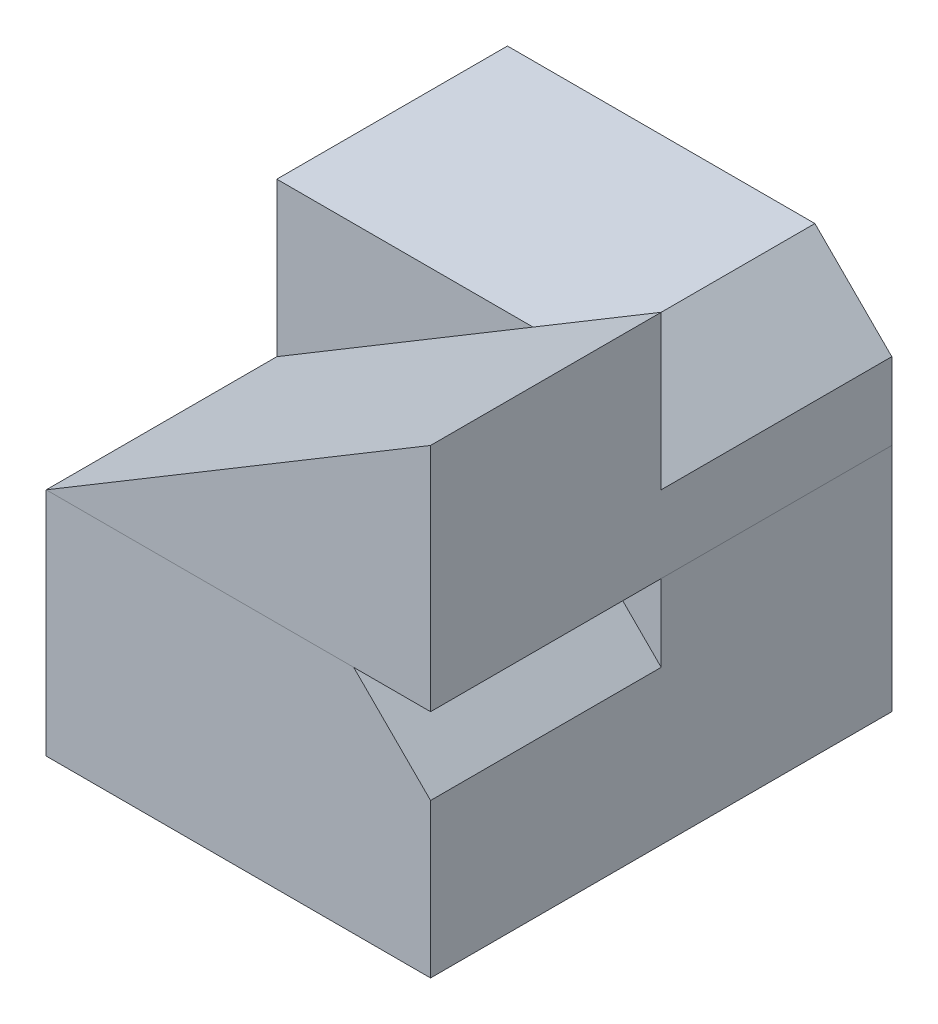
ISO-10303-21;
HEADER;
FILE_DESCRIPTION(('STEP AP214'),'2;1');
FILE_NAME('part.step','',(''),(''),'','','');
FILE_SCHEMA(('AUTOMOTIVE_DESIGN { 1 0 10303 214 1 1 1 1 }'));
ENDSEC;
DATA;
#1=APPLICATION_CONTEXT('core data for automotive mechanical design processes');
#2=APPLICATION_PROTOCOL_DEFINITION('international standard','automotive_design',2000,#1);
#3=PRODUCT_CONTEXT('',#1,'mechanical');
#4=PRODUCT('Part','Part','',(#3));
#5=PRODUCT_RELATED_PRODUCT_CATEGORY('part','',(#4));
#6=PRODUCT_DEFINITION_FORMATION('','',#4);
#7=PRODUCT_DEFINITION_CONTEXT('part definition',#1,'design');
#8=PRODUCT_DEFINITION('design','',#6,#7);
#9=PRODUCT_DEFINITION_SHAPE('','',#8);
#10=(LENGTH_UNIT() NAMED_UNIT(*) SI_UNIT(.MILLI.,.METRE.));
#11=(NAMED_UNIT(*) PLANE_ANGLE_UNIT() SI_UNIT($,.RADIAN.));
#12=(NAMED_UNIT(*) SI_UNIT($,.STERADIAN.) SOLID_ANGLE_UNIT());
#13=UNCERTAINTY_MEASURE_WITH_UNIT(LENGTH_MEASURE(1.E-05),#10,'distance_accuracy_value','');
#14=(GEOMETRIC_REPRESENTATION_CONTEXT(3) GLOBAL_UNCERTAINTY_ASSIGNED_CONTEXT((#13)) GLOBAL_UNIT_ASSIGNED_CONTEXT((#10,
#11,#12)) REPRESENTATION_CONTEXT('',''));
#15=CARTESIAN_POINT('',(0.,0.,0.));
#16=DIRECTION('',(0.,0.,1.));
#17=DIRECTION('',(1.,0.,0.));
#18=AXIS2_PLACEMENT_3D('',#15,#16,#17);
#19=CARTESIAN_POINT('',(0.,30.,30.));
#20=DIRECTION('',(0.514495755427526,-0.857492925712544,0.));
#21=DIRECTION('',(0.857492925712544,0.514495755427526,0.));
#22=AXIS2_PLACEMENT_3D('',#19,#20,#21);
#23=PLANE('',#22);
#24=DIRECTION('',(-0.857492925712544,-0.514495755427526,0.));
#25=VECTOR('',#24,1.);
#26=CARTESIAN_POINT('',(0.,30.,15.));
#27=LINE('',#26,#25);
#28=CARTESIAN_POINT('',(0.,30.,15.));
#29=VERTEX_POINT('',#28);
#30=CARTESIAN_POINT('',(-8.33333333333333,25.,15.));
#31=VERTEX_POINT('',#30);
#32=EDGE_CURVE('E128',#29,#31,#27,.T.);
#33=ORIENTED_EDGE('',*,*,#32,.T.);
#34=CARTESIAN_POINT('',(-25.,15.,15.));
#35=VERTEX_POINT('',#34);
#36=EDGE_CURVE('E126',#31,#35,#27,.T.);
#37=ORIENTED_EDGE('',*,*,#36,.T.);
#38=DIRECTION('',(0.,0.,-1.));
#39=VECTOR('',#38,1.);
#40=CARTESIAN_POINT('',(-25.,15.,30.));
#41=LINE('',#40,#39);
#42=CARTESIAN_POINT('',(-25.,15.,30.));
#43=VERTEX_POINT('',#42);
#44=EDGE_CURVE('E51',#43,#35,#41,.T.);
#45=ORIENTED_EDGE('',*,*,#44,.F.);
#46=DIRECTION('',(-0.857492925712544,-0.514495755427526,0.));
#47=VECTOR('',#46,1.);
#48=CARTESIAN_POINT('',(0.,30.,30.));
#49=LINE('',#48,#47);
#50=CARTESIAN_POINT('',(0.,30.,30.));
#51=VERTEX_POINT('',#50);
#52=EDGE_CURVE('E134',#51,#43,#49,.T.);
#53=ORIENTED_EDGE('',*,*,#52,.F.);
#54=DIRECTION('',(0.,0.,-1.));
#55=VECTOR('',#54,1.);
#56=CARTESIAN_POINT('',(0.,30.,30.));
#57=LINE('',#56,#55);
#58=EDGE_CURVE('E140',#51,#29,#57,.T.);
#59=ORIENTED_EDGE('',*,*,#58,.T.);
#60=EDGE_LOOP('',(#33,#37,#45,#53,#59));
#61=FACE_BOUND('',#60,.T.);
#62=ADVANCED_FACE('F43',(#61),#23,.F.);
#63=CARTESIAN_POINT('',(-25.,15.,30.));
#64=DIRECTION('',(0.,1.,0.));
#65=DIRECTION('',(0.,0.,1.));
#66=AXIS2_PLACEMENT_3D('',#63,#64,#65);
#67=PLANE('',#66);
#68=ORIENTED_EDGE('',*,*,#44,.T.);
#69=DIRECTION('',(0.,0.,1.));
#70=VECTOR('',#69,1.);
#71=CARTESIAN_POINT('',(-25.,15.,0.));
#72=LINE('',#71,#70);
#73=CARTESIAN_POINT('',(-25.,15.,0.));
#74=VERTEX_POINT('',#73);
#75=EDGE_CURVE('E105',#74,#35,#72,.T.);
#76=ORIENTED_EDGE('',*,*,#75,.F.);
#77=DIRECTION('',(-1.,0.,0.));
#78=VECTOR('',#77,1.);
#79=CARTESIAN_POINT('',(0.,15.,0.));
#80=LINE('',#79,#78);
#81=CARTESIAN_POINT('',(0.,15.,0.));
#82=VERTEX_POINT('',#81);
#83=EDGE_CURVE('E111',#82,#74,#80,.T.);
#84=ORIENTED_EDGE('',*,*,#83,.F.);
#85=DIRECTION('',(0.,0.,-1.));
#86=VECTOR('',#85,1.);
#87=CARTESIAN_POINT('',(0.,15.,30.));
#88=LINE('',#87,#86);
#89=CARTESIAN_POINT('',(0.,15.,30.));
#90=VERTEX_POINT('',#89);
#91=EDGE_CURVE('E198',#90,#82,#88,.T.);
#92=ORIENTED_EDGE('',*,*,#91,.F.);
#93=DIRECTION('',(1.,0.,0.));
#94=VECTOR('',#93,1.);
#95=CARTESIAN_POINT('',(-25.,15.,30.));
#96=LINE('',#95,#94);
#97=EDGE_CURVE('E137',#43,#90,#96,.T.);
#98=ORIENTED_EDGE('',*,*,#97,.F.);
#99=EDGE_LOOP('',(#68,#76,#84,#92,#98));
#100=FACE_BOUND('',#99,.T.);
#101=ADVANCED_FACE('F123',(#100),#67,.F.);
#102=CARTESIAN_POINT('',(0.,15.,30.));
#103=DIRECTION('',(-1.,0.,0.));
#104=DIRECTION('',(0.,0.,1.));
#105=AXIS2_PLACEMENT_3D('',#102,#103,#104);
#106=PLANE('',#105);
#107=ORIENTED_EDGE('',*,*,#91,.T.);
#108=DIRECTION('',(0.,-1.,0.));
#109=VECTOR('',#108,1.);
#110=CARTESIAN_POINT('',(0.,20.,0.));
#111=LINE('',#110,#109);
#112=CARTESIAN_POINT('',(0.,20.,0.));
#113=VERTEX_POINT('',#112);
#114=EDGE_CURVE('E117',#113,#82,#111,.T.);
#115=ORIENTED_EDGE('',*,*,#114,.F.);
#116=DIRECTION('',(0.,0.,1.));
#117=VECTOR('',#116,1.);
#118=CARTESIAN_POINT('',(0.,20.,0.));
#119=LINE('',#118,#117);
#120=CARTESIAN_POINT('',(0.,20.,15.));
#121=VERTEX_POINT('',#120);
#122=EDGE_CURVE('E149',#113,#121,#119,.T.);
#123=ORIENTED_EDGE('',*,*,#122,.T.);
#124=DIRECTION('',(0.,1.,0.));
#125=VECTOR('',#124,1.);
#126=CARTESIAN_POINT('',(0.,15.,15.));
#127=LINE('',#126,#125);
#128=EDGE_CURVE('E60',#121,#29,#127,.T.);
#129=ORIENTED_EDGE('',*,*,#128,.T.);
#130=ORIENTED_EDGE('',*,*,#58,.F.);
#131=DIRECTION('',(0.,1.,0.));
#132=VECTOR('',#131,1.);
#133=CARTESIAN_POINT('',(0.,15.,30.));
#134=LINE('',#133,#132);
#135=EDGE_CURVE('E139',#90,#51,#134,.T.);
#136=ORIENTED_EDGE('',*,*,#135,.F.);
#137=EDGE_LOOP('',(#107,#115,#123,#129,#130,#136));
#138=FACE_BOUND('',#137,.T.);
#139=ADVANCED_FACE('F184',(#138),#106,.F.);
#140=CARTESIAN_POINT('',(0.,0.,30.));
#141=DIRECTION('',(0.,0.,-1.));
#142=DIRECTION('',(-1.,0.,0.));
#143=AXIS2_PLACEMENT_3D('',#140,#141,#142);
#144=PLANE('',#143);
#145=ORIENTED_EDGE('',*,*,#52,.T.);
#146=ORIENTED_EDGE('',*,*,#97,.T.);
#147=ORIENTED_EDGE('',*,*,#135,.T.);
#148=EDGE_LOOP('',(#145,#146,#147));
#149=FACE_BOUND('',#148,.T.);
#150=ADVANCED_FACE('F177',(#149),#144,.F.);
#151=CARTESIAN_POINT('',(0.,0.,15.));
#152=DIRECTION('',(0.,0.,-1.));
#153=DIRECTION('',(-1.,0.,0.));
#154=AXIS2_PLACEMENT_3D('',#151,#152,#153);
#155=PLANE('',#154);
#156=DIRECTION('',(0.707106781186548,-0.707106781186547,0.));
#157=VECTOR('',#156,1.);
#158=CARTESIAN_POINT('',(-5.,25.,15.));
#159=LINE('',#158,#157);
#160=CARTESIAN_POINT('',(-5.,25.,15.));
#161=VERTEX_POINT('',#160);
#162=EDGE_CURVE('E120',#161,#121,#159,.T.);
#163=ORIENTED_EDGE('',*,*,#162,.F.);
#164=DIRECTION('',(1.,0.,0.));
#165=VECTOR('',#164,1.);
#166=CARTESIAN_POINT('',(-25.,25.,15.));
#167=LINE('',#166,#165);
#168=EDGE_CURVE('E12',#31,#161,#167,.T.);
#169=ORIENTED_EDGE('',*,*,#168,.F.);
#170=ORIENTED_EDGE('',*,*,#32,.F.);
#171=ORIENTED_EDGE('',*,*,#128,.F.);
#172=EDGE_LOOP('',(#163,#169,#170,#171));
#173=FACE_BOUND('',#172,.T.);
#174=ADVANCED_FACE('F175',(#173),#155,.T.);
#175=CARTESIAN_POINT('',(-25.,15.,0.));
#176=DIRECTION('',(1.,0.,0.));
#177=DIRECTION('',(0.,0.,-1.));
#178=AXIS2_PLACEMENT_3D('',#175,#176,#177);
#179=PLANE('',#178);
#180=DIRECTION('',(0.,1.,0.));
#181=VECTOR('',#180,1.);
#182=CARTESIAN_POINT('',(-25.,15.,15.));
#183=LINE('',#182,#181);
#184=CARTESIAN_POINT('',(-25.,25.,15.));
#185=VERTEX_POINT('',#184);
#186=EDGE_CURVE('E163',#35,#185,#183,.T.);
#187=ORIENTED_EDGE('',*,*,#186,.T.);
#188=DIRECTION('',(0.,0.,1.));
#189=VECTOR('',#188,1.);
#190=CARTESIAN_POINT('',(-25.,25.,0.));
#191=LINE('',#190,#189);
#192=CARTESIAN_POINT('',(-25.,25.,0.));
#193=VERTEX_POINT('',#192);
#194=EDGE_CURVE('E107',#193,#185,#191,.T.);
#195=ORIENTED_EDGE('',*,*,#194,.F.);
#196=DIRECTION('',(0.,1.,0.));
#197=VECTOR('',#196,1.);
#198=CARTESIAN_POINT('',(-25.,15.,0.));
#199=LINE('',#198,#197);
#200=EDGE_CURVE('E101',#74,#193,#199,.T.);
#201=ORIENTED_EDGE('',*,*,#200,.F.);
#202=ORIENTED_EDGE('',*,*,#75,.T.);
#203=EDGE_LOOP('',(#187,#195,#201,#202));
#204=FACE_BOUND('',#203,.T.);
#205=ADVANCED_FACE('F103',(#204),#179,.F.);
#206=CARTESIAN_POINT('',(-25.,25.,0.));
#207=DIRECTION('',(0.,-1.,0.));
#208=DIRECTION('',(1.,0.,0.));
#209=AXIS2_PLACEMENT_3D('',#206,#207,#208);
#210=PLANE('',#209);
#211=EDGE_CURVE('E53',#185,#31,#167,.T.);
#212=ORIENTED_EDGE('',*,*,#211,.T.);
#213=ORIENTED_EDGE('',*,*,#168,.T.);
#214=DIRECTION('',(0.,0.,1.));
#215=VECTOR('',#214,1.);
#216=CARTESIAN_POINT('',(-5.,25.,0.));
#217=LINE('',#216,#215);
#218=CARTESIAN_POINT('',(-5.,25.,0.));
#219=VERTEX_POINT('',#218);
#220=EDGE_CURVE('E130',#219,#161,#217,.T.);
#221=ORIENTED_EDGE('',*,*,#220,.F.);
#222=DIRECTION('',(1.,0.,0.));
#223=VECTOR('',#222,1.);
#224=CARTESIAN_POINT('',(-25.,25.,0.));
#225=LINE('',#224,#223);
#226=EDGE_CURVE('E110',#193,#219,#225,.T.);
#227=ORIENTED_EDGE('',*,*,#226,.F.);
#228=ORIENTED_EDGE('',*,*,#194,.T.);
#229=EDGE_LOOP('',(#212,#213,#221,#227,#228));
#230=FACE_BOUND('',#229,.T.);
#231=ADVANCED_FACE('F167',(#230),#210,.F.);
#232=CARTESIAN_POINT('',(-5.,25.,0.));
#233=DIRECTION('',(-0.707106781186547,-0.707106781186548,0.));
#234=DIRECTION('',(0.707106781186548,-0.707106781186547,0.));
#235=AXIS2_PLACEMENT_3D('',#232,#233,#234);
#236=PLANE('',#235);
#237=ORIENTED_EDGE('',*,*,#162,.T.);
#238=ORIENTED_EDGE('',*,*,#122,.F.);
#239=DIRECTION('',(0.707106781186548,-0.707106781186547,0.));
#240=VECTOR('',#239,1.);
#241=CARTESIAN_POINT('',(-5.,25.,0.));
#242=LINE('',#241,#240);
#243=EDGE_CURVE('E159',#219,#113,#242,.T.);
#244=ORIENTED_EDGE('',*,*,#243,.F.);
#245=ORIENTED_EDGE('',*,*,#220,.T.);
#246=EDGE_LOOP('',(#237,#238,#244,#245));
#247=FACE_BOUND('',#246,.T.);
#248=ADVANCED_FACE('F237',(#247),#236,.F.);
#249=CARTESIAN_POINT('',(0.,0.,0.));
#250=DIRECTION('',(0.,0.,-1.));
#251=DIRECTION('',(-1.,0.,0.));
#252=AXIS2_PLACEMENT_3D('',#249,#250,#251);
#253=PLANE('',#252);
#254=ORIENTED_EDGE('',*,*,#83,.T.);
#255=ORIENTED_EDGE('',*,*,#200,.T.);
#256=ORIENTED_EDGE('',*,*,#226,.T.);
#257=ORIENTED_EDGE('',*,*,#243,.T.);
#258=ORIENTED_EDGE('',*,*,#114,.T.);
#259=EDGE_LOOP('',(#254,#255,#256,#257,#258));
#260=FACE_BOUND('',#259,.T.);
#261=ADVANCED_FACE('F115',(#260),#253,.T.);
#262=CARTESIAN_POINT('',(0.,0.,15.));
#263=DIRECTION('',(0.,0.,-1.));
#264=DIRECTION('',(-1.,0.,0.));
#265=AXIS2_PLACEMENT_3D('',#262,#263,#264);
#266=PLANE('',#265);
#267=ORIENTED_EDGE('',*,*,#36,.F.);
#268=ORIENTED_EDGE('',*,*,#211,.F.);
#269=ORIENTED_EDGE('',*,*,#186,.F.);
#270=EDGE_LOOP('',(#267,#268,#269));
#271=FACE_BOUND('',#270,.T.);
#272=ADVANCED_FACE('F170',(#271),#266,.F.);
#273=CLOSED_SHELL('',(#62,#101,#139,#150,#174,#205,#231,#248,#261,#272));
#274=MANIFOLD_SOLID_BREP('B2',#273);
#275=CARTESIAN_POINT('',(0.,0.,15.));
#276=DIRECTION('',(0.,0.,-1.));
#277=DIRECTION('',(-1.,0.,0.));
#278=AXIS2_PLACEMENT_3D('',#275,#276,#277);
#279=PLANE('',#278);
#280=DIRECTION('',(-0.707106781186548,0.707106781186547,0.));
#281=VECTOR('',#280,1.);
#282=CARTESIAN_POINT('',(-5.,15.,15.));
#283=LINE('',#282,#281);
#284=CARTESIAN_POINT('',(0.,10.,15.));
#285=VERTEX_POINT('',#284);
#286=CARTESIAN_POINT('',(-3.125,13.125,15.));
#287=VERTEX_POINT('',#286);
#288=EDGE_CURVE('E286',#285,#287,#283,.T.);
#289=ORIENTED_EDGE('',*,*,#288,.F.);
#290=DIRECTION('',(0.,1.,0.));
#291=VECTOR('',#290,1.);
#292=CARTESIAN_POINT('',(0.,0.,15.));
#293=LINE('',#292,#291);
#294=CARTESIAN_POINT('',(0.,15.,15.));
#295=VERTEX_POINT('',#294);
#296=EDGE_CURVE('E290',#285,#295,#293,.T.);
#297=ORIENTED_EDGE('',*,*,#296,.T.);
#298=DIRECTION('',(-0.857492925712544,-0.514495755427526,0.));
#299=VECTOR('',#298,1.);
#300=CARTESIAN_POINT('',(0.,15.,15.));
#301=LINE('',#300,#299);
#302=EDGE_CURVE('E323',#295,#287,#301,.T.);
#303=ORIENTED_EDGE('',*,*,#302,.T.);
#304=EDGE_LOOP('',(#289,#297,#303));
#305=FACE_BOUND('',#304,.T.);
#306=ADVANCED_FACE('F269',(#305),#279,.F.);
#307=CARTESIAN_POINT('',(0.,15.,15.));
#308=DIRECTION('',(0.514495755427526,-0.857492925712544,0.));
#309=DIRECTION('',(0.857492925712544,0.514495755427526,0.));
#310=AXIS2_PLACEMENT_3D('',#307,#308,#309);
#311=PLANE('',#310);
#312=DIRECTION('',(-0.857492925712544,-0.514495755427526,0.));
#313=VECTOR('',#312,1.);
#314=CARTESIAN_POINT('',(0.,15.,0.));
#315=LINE('',#314,#313);
#316=CARTESIAN_POINT('',(0.,15.,0.));
#317=VERTEX_POINT('',#316);
#318=CARTESIAN_POINT('',(-25.,0.,0.));
#319=VERTEX_POINT('',#318);
#320=EDGE_CURVE('E321',#317,#319,#315,.T.);
#321=ORIENTED_EDGE('',*,*,#320,.T.);
#322=DIRECTION('',(0.,0.,-1.));
#323=VECTOR('',#322,1.);
#324=CARTESIAN_POINT('',(-25.,0.,15.));
#325=LINE('',#324,#323);
#326=CARTESIAN_POINT('',(-25.,0.,15.));
#327=VERTEX_POINT('',#326);
#328=EDGE_CURVE('E41',#327,#319,#325,.T.);
#329=ORIENTED_EDGE('',*,*,#328,.F.);
#330=EDGE_CURVE('E316',#287,#327,#301,.T.);
#331=ORIENTED_EDGE('',*,*,#330,.F.);
#332=ORIENTED_EDGE('',*,*,#302,.F.);
#333=DIRECTION('',(0.,0.,-1.));
#334=VECTOR('',#333,1.);
#335=CARTESIAN_POINT('',(0.,15.,15.));
#336=LINE('',#335,#334);
#337=EDGE_CURVE('E310',#295,#317,#336,.T.);
#338=ORIENTED_EDGE('',*,*,#337,.T.);
#339=EDGE_LOOP('',(#321,#329,#331,#332,#338));
#340=FACE_BOUND('',#339,.T.);
#341=ADVANCED_FACE('F271',(#340),#311,.F.);
#342=CARTESIAN_POINT('',(-25.,0.,15.));
#343=DIRECTION('',(0.,1.,0.));
#344=DIRECTION('',(0.,0.,1.));
#345=AXIS2_PLACEMENT_3D('',#342,#343,#344);
#346=PLANE('',#345);
#347=DIRECTION('',(1.,0.,0.));
#348=VECTOR('',#347,1.);
#349=CARTESIAN_POINT('',(-25.,0.,0.));
#350=LINE('',#349,#348);
#351=CARTESIAN_POINT('',(0.,0.,0.));
#352=VERTEX_POINT('',#351);
#353=EDGE_CURVE('E317',#319,#352,#350,.T.);
#354=ORIENTED_EDGE('',*,*,#353,.T.);
#355=DIRECTION('',(0.,0.,-1.));
#356=VECTOR('',#355,1.);
#357=CARTESIAN_POINT('',(0.,0.,15.));
#358=LINE('',#357,#356);
#359=CARTESIAN_POINT('',(0.,0.,30.));
#360=VERTEX_POINT('',#359);
#361=EDGE_CURVE('E278',#360,#352,#358,.T.);
#362=ORIENTED_EDGE('',*,*,#361,.F.);
#363=DIRECTION('',(1.,0.,0.));
#364=VECTOR('',#363,1.);
#365=CARTESIAN_POINT('',(0.,0.,30.));
#366=LINE('',#365,#364);
#367=CARTESIAN_POINT('',(-25.,0.,30.));
#368=VERTEX_POINT('',#367);
#369=EDGE_CURVE('E351',#368,#360,#366,.T.);
#370=ORIENTED_EDGE('',*,*,#369,.F.);
#371=DIRECTION('',(0.,0.,-1.));
#372=VECTOR('',#371,1.);
#373=CARTESIAN_POINT('',(-25.,0.,30.));
#374=LINE('',#373,#372);
#375=EDGE_CURVE('E352',#368,#327,#374,.T.);
#376=ORIENTED_EDGE('',*,*,#375,.T.);
#377=ORIENTED_EDGE('',*,*,#328,.T.);
#378=EDGE_LOOP('',(#354,#362,#370,#376,#377));
#379=FACE_BOUND('',#378,.T.);
#380=ADVANCED_FACE('F374',(#379),#346,.F.);
#381=CARTESIAN_POINT('',(0.,0.,15.));
#382=DIRECTION('',(-1.,0.,0.));
#383=DIRECTION('',(0.,0.,1.));
#384=AXIS2_PLACEMENT_3D('',#381,#382,#383);
#385=PLANE('',#384);
#386=DIRECTION('',(0.,1.,0.));
#387=VECTOR('',#386,1.);
#388=CARTESIAN_POINT('',(0.,0.,0.));
#389=LINE('',#388,#387);
#390=EDGE_CURVE('E307',#352,#317,#389,.T.);
#391=ORIENTED_EDGE('',*,*,#390,.T.);
#392=ORIENTED_EDGE('',*,*,#337,.F.);
#393=ORIENTED_EDGE('',*,*,#296,.F.);
#394=DIRECTION('',(0.,0.,-1.));
#395=VECTOR('',#394,1.);
#396=CARTESIAN_POINT('',(0.,10.,30.));
#397=LINE('',#396,#395);
#398=CARTESIAN_POINT('',(0.,10.,30.));
#399=VERTEX_POINT('',#398);
#400=EDGE_CURVE('E326',#399,#285,#397,.T.);
#401=ORIENTED_EDGE('',*,*,#400,.F.);
#402=DIRECTION('',(0.,1.,0.));
#403=VECTOR('',#402,1.);
#404=CARTESIAN_POINT('',(0.,10.,30.));
#405=LINE('',#404,#403);
#406=EDGE_CURVE('E382',#360,#399,#405,.T.);
#407=ORIENTED_EDGE('',*,*,#406,.F.);
#408=ORIENTED_EDGE('',*,*,#361,.T.);
#409=EDGE_LOOP('',(#391,#392,#393,#401,#407,#408));
#410=FACE_BOUND('',#409,.T.);
#411=ADVANCED_FACE('F309',(#410),#385,.F.);
#412=CARTESIAN_POINT('',(0.,0.,0.));
#413=DIRECTION('',(0.,0.,-1.));
#414=DIRECTION('',(-1.,0.,0.));
#415=AXIS2_PLACEMENT_3D('',#412,#413,#414);
#416=PLANE('',#415);
#417=ORIENTED_EDGE('',*,*,#320,.F.);
#418=ORIENTED_EDGE('',*,*,#390,.F.);
#419=ORIENTED_EDGE('',*,*,#353,.F.);
#420=EDGE_LOOP('',(#417,#418,#419));
#421=FACE_BOUND('',#420,.T.);
#422=ADVANCED_FACE('F325',(#421),#416,.T.);
#423=CARTESIAN_POINT('',(-5.,15.,30.));
#424=DIRECTION('',(-0.707106781186547,-0.707106781186548,0.));
#425=DIRECTION('',(0.707106781186548,-0.707106781186547,0.));
#426=AXIS2_PLACEMENT_3D('',#423,#424,#425);
#427=PLANE('',#426);
#428=ORIENTED_EDGE('',*,*,#288,.T.);
#429=CARTESIAN_POINT('',(-5.,15.,15.));
#430=VERTEX_POINT('',#429);
#431=EDGE_CURVE('E339',#287,#430,#283,.T.);
#432=ORIENTED_EDGE('',*,*,#431,.T.);
#433=DIRECTION('',(0.,0.,-1.));
#434=VECTOR('',#433,1.);
#435=CARTESIAN_POINT('',(-5.,15.,30.));
#436=LINE('',#435,#434);
#437=CARTESIAN_POINT('',(-5.,15.,30.));
#438=VERTEX_POINT('',#437);
#439=EDGE_CURVE('E330',#438,#430,#436,.T.);
#440=ORIENTED_EDGE('',*,*,#439,.F.);
#441=DIRECTION('',(-0.707106781186548,0.707106781186547,0.));
#442=VECTOR('',#441,1.);
#443=CARTESIAN_POINT('',(-5.,15.,30.));
#444=LINE('',#443,#442);
#445=EDGE_CURVE('E384',#399,#438,#444,.T.);
#446=ORIENTED_EDGE('',*,*,#445,.F.);
#447=ORIENTED_EDGE('',*,*,#400,.T.);
#448=EDGE_LOOP('',(#428,#432,#440,#446,#447));
#449=FACE_BOUND('',#448,.T.);
#450=ADVANCED_FACE('F406',(#449),#427,.F.);
#451=CARTESIAN_POINT('',(-25.,15.,30.));
#452=DIRECTION('',(0.,-1.,0.));
#453=DIRECTION('',(0.,0.,-1.));
#454=AXIS2_PLACEMENT_3D('',#451,#452,#453);
#455=PLANE('',#454);
#456=DIRECTION('',(-1.,0.,0.));
#457=VECTOR('',#456,1.);
#458=CARTESIAN_POINT('',(-25.,15.,15.));
#459=LINE('',#458,#457);
#460=CARTESIAN_POINT('',(-25.,15.,15.));
#461=VERTEX_POINT('',#460);
#462=EDGE_CURVE('E338',#430,#461,#459,.T.);
#463=ORIENTED_EDGE('',*,*,#462,.T.);
#464=DIRECTION('',(0.,0.,-1.));
#465=VECTOR('',#464,1.);
#466=CARTESIAN_POINT('',(-25.,15.,30.));
#467=LINE('',#466,#465);
#468=CARTESIAN_POINT('',(-25.,15.,30.));
#469=VERTEX_POINT('',#468);
#470=EDGE_CURVE('E355',#469,#461,#467,.T.);
#471=ORIENTED_EDGE('',*,*,#470,.F.);
#472=DIRECTION('',(-1.,0.,0.));
#473=VECTOR('',#472,1.);
#474=CARTESIAN_POINT('',(-25.,15.,30.));
#475=LINE('',#474,#473);
#476=EDGE_CURVE('E388',#438,#469,#475,.T.);
#477=ORIENTED_EDGE('',*,*,#476,.F.);
#478=ORIENTED_EDGE('',*,*,#439,.T.);
#479=EDGE_LOOP('',(#463,#471,#477,#478));
#480=FACE_BOUND('',#479,.T.);
#481=ADVANCED_FACE('F407',(#480),#455,.F.);
#482=CARTESIAN_POINT('',(-25.,0.,30.));
#483=DIRECTION('',(1.,0.,0.));
#484=DIRECTION('',(0.,0.,-1.));
#485=AXIS2_PLACEMENT_3D('',#482,#483,#484);
#486=PLANE('',#485);
#487=DIRECTION('',(0.,-1.,0.));
#488=VECTOR('',#487,1.);
#489=CARTESIAN_POINT('',(-25.,0.,15.));
#490=LINE('',#489,#488);
#491=EDGE_CURVE('E348',#461,#327,#490,.T.);
#492=ORIENTED_EDGE('',*,*,#491,.T.);
#493=ORIENTED_EDGE('',*,*,#375,.F.);
#494=DIRECTION('',(0.,-1.,0.));
#495=VECTOR('',#494,1.);
#496=CARTESIAN_POINT('',(-25.,0.,30.));
#497=LINE('',#496,#495);
#498=EDGE_CURVE('E344',#469,#368,#497,.T.);
#499=ORIENTED_EDGE('',*,*,#498,.F.);
#500=ORIENTED_EDGE('',*,*,#470,.T.);
#501=EDGE_LOOP('',(#492,#493,#499,#500));
#502=FACE_BOUND('',#501,.T.);
#503=ADVANCED_FACE('F368',(#502),#486,.F.);
#504=CARTESIAN_POINT('',(0.,0.,30.));
#505=DIRECTION('',(0.,0.,-1.));
#506=DIRECTION('',(-1.,0.,0.));
#507=AXIS2_PLACEMENT_3D('',#504,#505,#506);
#508=PLANE('',#507);
#509=ORIENTED_EDGE('',*,*,#369,.T.);
#510=ORIENTED_EDGE('',*,*,#406,.T.);
#511=ORIENTED_EDGE('',*,*,#445,.T.);
#512=ORIENTED_EDGE('',*,*,#476,.T.);
#513=ORIENTED_EDGE('',*,*,#498,.T.);
#514=EDGE_LOOP('',(#509,#510,#511,#512,#513));
#515=FACE_BOUND('',#514,.T.);
#516=ADVANCED_FACE('F391',(#515),#508,.F.);
#517=CARTESIAN_POINT('',(0.,0.,15.));
#518=DIRECTION('',(0.,0.,-1.));
#519=DIRECTION('',(-1.,0.,0.));
#520=AXIS2_PLACEMENT_3D('',#517,#518,#519);
#521=PLANE('',#520);
#522=ORIENTED_EDGE('',*,*,#431,.F.);
#523=ORIENTED_EDGE('',*,*,#330,.T.);
#524=ORIENTED_EDGE('',*,*,#491,.F.);
#525=ORIENTED_EDGE('',*,*,#462,.F.);
#526=EDGE_LOOP('',(#522,#523,#524,#525));
#527=FACE_BOUND('',#526,.T.);
#528=ADVANCED_FACE('F363',(#527),#521,.T.);
#529=CLOSED_SHELL('',(#306,#341,#380,#411,#422,#450,#481,#503,#516,#528));
#530=MANIFOLD_SOLID_BREP('B6',#529);
#531=ADVANCED_BREP_SHAPE_REPRESENTATION('',(#18,#274,#530),#14);
#532=SHAPE_DEFINITION_REPRESENTATION(#9,#531);
ENDSEC;
END-ISO-10303-21;
